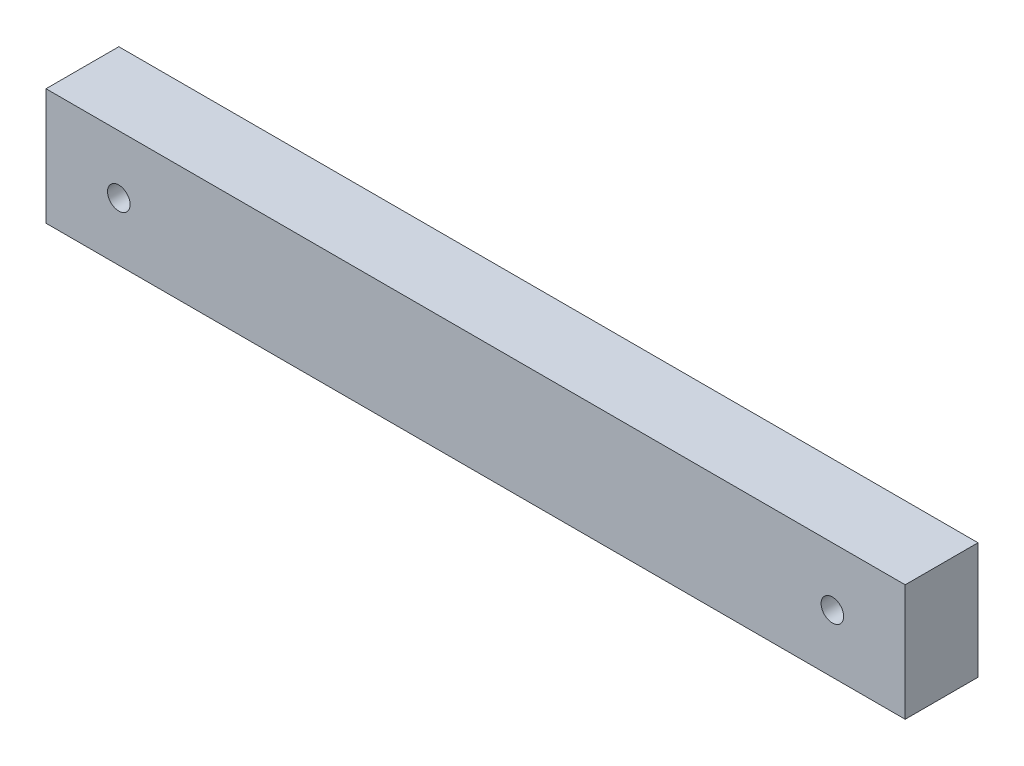
ISO-10303-21;
HEADER;
FILE_DESCRIPTION(('STEP AP214'),'2;1');
FILE_NAME('part.step','',(''),(''),'','','');
FILE_SCHEMA(('AUTOMOTIVE_DESIGN { 1 0 10303 214 1 1 1 1 }'));
ENDSEC;
DATA;
#1=APPLICATION_CONTEXT('core data for automotive mechanical design processes');
#2=APPLICATION_PROTOCOL_DEFINITION('international standard','automotive_design',2000,#1);
#3=PRODUCT_CONTEXT('',#1,'mechanical');
#4=PRODUCT('Part','Part','',(#3));
#5=PRODUCT_RELATED_PRODUCT_CATEGORY('part','',(#4));
#6=PRODUCT_DEFINITION_FORMATION('','',#4);
#7=PRODUCT_DEFINITION_CONTEXT('part definition',#1,'design');
#8=PRODUCT_DEFINITION('design','',#6,#7);
#9=PRODUCT_DEFINITION_SHAPE('','',#8);
#10=(LENGTH_UNIT() NAMED_UNIT(*) SI_UNIT(.MILLI.,.METRE.));
#11=(NAMED_UNIT(*) PLANE_ANGLE_UNIT() SI_UNIT($,.RADIAN.));
#12=(NAMED_UNIT(*) SI_UNIT($,.STERADIAN.) SOLID_ANGLE_UNIT());
#13=UNCERTAINTY_MEASURE_WITH_UNIT(LENGTH_MEASURE(1.E-05),#10,'distance_accuracy_value','');
#14=(GEOMETRIC_REPRESENTATION_CONTEXT(3) GLOBAL_UNCERTAINTY_ASSIGNED_CONTEXT((#13)) GLOBAL_UNIT_ASSIGNED_CONTEXT((#10,
#11,#12)) REPRESENTATION_CONTEXT('',''));
#15=CARTESIAN_POINT('',(0.,0.,0.));
#16=DIRECTION('',(0.,0.,1.));
#17=DIRECTION('',(1.,0.,0.));
#18=AXIS2_PLACEMENT_3D('',#15,#16,#17);
#19=CARTESIAN_POINT('',(0.,0.,10.));
#20=DIRECTION('',(0.,0.,1.));
#21=DIRECTION('',(1.,0.,0.));
#22=AXIS2_PLACEMENT_3D('',#19,#20,#21);
#23=PLANE('',#22);
#24=CARTESIAN_POINT('',(-49.,0.,10.));
#25=DIRECTION('',(0.,0.,1.));
#26=DIRECTION('',(1.,0.,0.));
#27=AXIS2_PLACEMENT_3D('',#24,#25,#26);
#28=CIRCLE('',#27,1.54999999999999);
#29=CARTESIAN_POINT('',(-47.45,0.,10.));
#30=VERTEX_POINT('',#29);
#31=EDGE_CURVE('E105',#30,#30,#28,.T.);
#32=ORIENTED_EDGE('',*,*,#31,.F.);
#33=EDGE_LOOP('',(#32));
#34=FACE_BOUND('',#33,.T.);
#35=DIRECTION('',(0.,1.,0.));
#36=VECTOR('',#35,1.);
#37=CARTESIAN_POINT('',(59.,8.00000000000003,10.));
#38=LINE('',#37,#36);
#39=CARTESIAN_POINT('',(59.,-8.00000000000003,10.));
#40=VERTEX_POINT('',#39);
#41=CARTESIAN_POINT('',(59.,8.00000000000003,10.));
#42=VERTEX_POINT('',#41);
#43=EDGE_CURVE('E90',#40,#42,#38,.T.);
#44=ORIENTED_EDGE('',*,*,#43,.T.);
#45=DIRECTION('',(-1.,0.,0.));
#46=VECTOR('',#45,1.);
#47=CARTESIAN_POINT('',(-59.,8.,10.));
#48=LINE('',#47,#46);
#49=CARTESIAN_POINT('',(-59.,8.,10.));
#50=VERTEX_POINT('',#49);
#51=EDGE_CURVE('E85',#42,#50,#48,.T.);
#52=ORIENTED_EDGE('',*,*,#51,.T.);
#53=DIRECTION('',(0.,-1.,0.));
#54=VECTOR('',#53,1.);
#55=CARTESIAN_POINT('',(-59.,8.,10.));
#56=LINE('',#55,#54);
#57=CARTESIAN_POINT('',(-59.,-8.,10.));
#58=VERTEX_POINT('',#57);
#59=EDGE_CURVE('E88',#50,#58,#56,.T.);
#60=ORIENTED_EDGE('',*,*,#59,.T.);
#61=DIRECTION('',(1.,0.,0.));
#62=VECTOR('',#61,1.);
#63=CARTESIAN_POINT('',(-59.,-8.,10.));
#64=LINE('',#63,#62);
#65=EDGE_CURVE('E55',#58,#40,#64,.T.);
#66=ORIENTED_EDGE('',*,*,#65,.T.);
#67=EDGE_LOOP('',(#44,#52,#60,#66));
#68=FACE_BOUND('',#67,.T.);
#69=CARTESIAN_POINT('',(49.,0.,10.));
#70=DIRECTION('',(0.,0.,1.));
#71=DIRECTION('',(1.,0.,0.));
#72=AXIS2_PLACEMENT_3D('',#69,#70,#71);
#73=CIRCLE('',#72,1.54999999999999);
#74=CARTESIAN_POINT('',(50.55,0.,10.));
#75=VERTEX_POINT('',#74);
#76=EDGE_CURVE('E120',#75,#75,#73,.T.);
#77=ORIENTED_EDGE('',*,*,#76,.F.);
#78=EDGE_LOOP('',(#77));
#79=FACE_BOUND('',#78,.T.);
#80=ADVANCED_FACE('F38',(#34,#68,#79),#23,.T.);
#81=CARTESIAN_POINT('',(0.,0.,0.));
#82=DIRECTION('',(0.,0.,1.));
#83=DIRECTION('',(1.,0.,0.));
#84=AXIS2_PLACEMENT_3D('',#81,#82,#83);
#85=PLANE('',#84);
#86=DIRECTION('',(0.,1.,0.));
#87=VECTOR('',#86,1.);
#88=CARTESIAN_POINT('',(59.,8.00000000000003,0.));
#89=LINE('',#88,#87);
#90=CARTESIAN_POINT('',(59.,-8.00000000000003,0.));
#91=VERTEX_POINT('',#90);
#92=CARTESIAN_POINT('',(59.,8.00000000000003,0.));
#93=VERTEX_POINT('',#92);
#94=EDGE_CURVE('E102',#91,#93,#89,.T.);
#95=ORIENTED_EDGE('',*,*,#94,.F.);
#96=DIRECTION('',(1.,0.,0.));
#97=VECTOR('',#96,1.);
#98=CARTESIAN_POINT('',(-59.,-8.,0.));
#99=LINE('',#98,#97);
#100=CARTESIAN_POINT('',(-59.,-8.,0.));
#101=VERTEX_POINT('',#100);
#102=EDGE_CURVE('E78',#101,#91,#99,.T.);
#103=ORIENTED_EDGE('',*,*,#102,.F.);
#104=DIRECTION('',(0.,-1.,0.));
#105=VECTOR('',#104,1.);
#106=CARTESIAN_POINT('',(-59.,8.,0.));
#107=LINE('',#106,#105);
#108=CARTESIAN_POINT('',(-59.,8.,0.));
#109=VERTEX_POINT('',#108);
#110=EDGE_CURVE('E72',#109,#101,#107,.T.);
#111=ORIENTED_EDGE('',*,*,#110,.F.);
#112=DIRECTION('',(-1.,0.,0.));
#113=VECTOR('',#112,1.);
#114=CARTESIAN_POINT('',(-59.,8.,0.));
#115=LINE('',#114,#113);
#116=EDGE_CURVE('E94',#93,#109,#115,.T.);
#117=ORIENTED_EDGE('',*,*,#116,.F.);
#118=EDGE_LOOP('',(#95,#103,#111,#117));
#119=FACE_BOUND('',#118,.T.);
#120=CARTESIAN_POINT('',(-49.,0.,0.));
#121=DIRECTION('',(0.,0.,1.));
#122=DIRECTION('',(1.,0.,0.));
#123=AXIS2_PLACEMENT_3D('',#120,#121,#122);
#124=CIRCLE('',#123,1.54999999999999);
#125=CARTESIAN_POINT('',(-47.45,0.,0.));
#126=VERTEX_POINT('',#125);
#127=EDGE_CURVE('E117',#126,#126,#124,.T.);
#128=ORIENTED_EDGE('',*,*,#127,.T.);
#129=EDGE_LOOP('',(#128));
#130=FACE_BOUND('',#129,.T.);
#131=CARTESIAN_POINT('',(49.,0.,0.));
#132=DIRECTION('',(0.,0.,1.));
#133=DIRECTION('',(1.,0.,0.));
#134=AXIS2_PLACEMENT_3D('',#131,#132,#133);
#135=CIRCLE('',#134,1.54999999999999);
#136=CARTESIAN_POINT('',(50.55,0.,0.));
#137=VERTEX_POINT('',#136);
#138=EDGE_CURVE('E123',#137,#137,#135,.T.);
#139=ORIENTED_EDGE('',*,*,#138,.T.);
#140=EDGE_LOOP('',(#139));
#141=FACE_BOUND('',#140,.T.);
#142=ADVANCED_FACE('F113',(#119,#130,#141),#85,.F.);
#143=CARTESIAN_POINT('',(59.,8.00000000000003,10.));
#144=DIRECTION('',(-1.,0.,0.));
#145=DIRECTION('',(0.,0.,1.));
#146=AXIS2_PLACEMENT_3D('',#143,#144,#145);
#147=PLANE('',#146);
#148=ORIENTED_EDGE('',*,*,#94,.T.);
#149=DIRECTION('',(0.,0.,-1.));
#150=VECTOR('',#149,1.);
#151=CARTESIAN_POINT('',(59.,8.00000000000003,10.));
#152=LINE('',#151,#150);
#153=EDGE_CURVE('E11',#42,#93,#152,.T.);
#154=ORIENTED_EDGE('',*,*,#153,.F.);
#155=ORIENTED_EDGE('',*,*,#43,.F.);
#156=DIRECTION('',(0.,0.,-1.));
#157=VECTOR('',#156,1.);
#158=CARTESIAN_POINT('',(59.,-8.00000000000003,10.));
#159=LINE('',#158,#157);
#160=EDGE_CURVE('E98',#40,#91,#159,.T.);
#161=ORIENTED_EDGE('',*,*,#160,.T.);
#162=EDGE_LOOP('',(#148,#154,#155,#161));
#163=FACE_BOUND('',#162,.T.);
#164=ADVANCED_FACE('F40',(#163),#147,.F.);
#165=CARTESIAN_POINT('',(-59.,8.,10.));
#166=DIRECTION('',(0.,-1.,0.));
#167=DIRECTION('',(1.,0.,0.));
#168=AXIS2_PLACEMENT_3D('',#165,#166,#167);
#169=PLANE('',#168);
#170=ORIENTED_EDGE('',*,*,#116,.T.);
#171=DIRECTION('',(0.,0.,-1.));
#172=VECTOR('',#171,1.);
#173=CARTESIAN_POINT('',(-59.,8.,10.));
#174=LINE('',#173,#172);
#175=EDGE_CURVE('E47',#50,#109,#174,.T.);
#176=ORIENTED_EDGE('',*,*,#175,.F.);
#177=ORIENTED_EDGE('',*,*,#51,.F.);
#178=ORIENTED_EDGE('',*,*,#153,.T.);
#179=EDGE_LOOP('',(#170,#176,#177,#178));
#180=FACE_BOUND('',#179,.T.);
#181=ADVANCED_FACE('F93',(#180),#169,.F.);
#182=CARTESIAN_POINT('',(-59.,8.,10.));
#183=DIRECTION('',(1.,0.,0.));
#184=DIRECTION('',(0.,0.,-1.));
#185=AXIS2_PLACEMENT_3D('',#182,#183,#184);
#186=PLANE('',#185);
#187=ORIENTED_EDGE('',*,*,#110,.T.);
#188=DIRECTION('',(0.,0.,-1.));
#189=VECTOR('',#188,1.);
#190=CARTESIAN_POINT('',(-59.,-8.,10.));
#191=LINE('',#190,#189);
#192=EDGE_CURVE('E95',#58,#101,#191,.T.);
#193=ORIENTED_EDGE('',*,*,#192,.F.);
#194=ORIENTED_EDGE('',*,*,#59,.F.);
#195=ORIENTED_EDGE('',*,*,#175,.T.);
#196=EDGE_LOOP('',(#187,#193,#194,#195));
#197=FACE_BOUND('',#196,.T.);
#198=ADVANCED_FACE('F96',(#197),#186,.F.);
#199=CARTESIAN_POINT('',(-59.,-8.,10.));
#200=DIRECTION('',(0.,1.,0.));
#201=DIRECTION('',(-1.,0.,0.));
#202=AXIS2_PLACEMENT_3D('',#199,#200,#201);
#203=PLANE('',#202);
#204=ORIENTED_EDGE('',*,*,#102,.T.);
#205=ORIENTED_EDGE('',*,*,#160,.F.);
#206=ORIENTED_EDGE('',*,*,#65,.F.);
#207=ORIENTED_EDGE('',*,*,#192,.T.);
#208=EDGE_LOOP('',(#204,#205,#206,#207));
#209=FACE_BOUND('',#208,.T.);
#210=ADVANCED_FACE('F110',(#209),#203,.F.);
#211=CARTESIAN_POINT('',(-49.,0.,10.));
#212=DIRECTION('',(0.,0.,-1.));
#213=DIRECTION('',(-1.,0.,0.));
#214=AXIS2_PLACEMENT_3D('',#211,#212,#213);
#215=CYLINDRICAL_SURFACE('',#214,1.54999999999999);
#216=ORIENTED_EDGE('',*,*,#31,.T.);
#217=EDGE_LOOP('',(#216));
#218=FACE_BOUND('',#217,.T.);
#219=ORIENTED_EDGE('',*,*,#127,.F.);
#220=EDGE_LOOP('',(#219));
#221=FACE_BOUND('',#220,.T.);
#222=ADVANCED_FACE('F140',(#218,#221),#215,.F.);
#223=CARTESIAN_POINT('',(49.,0.,10.));
#224=DIRECTION('',(0.,0.,-1.));
#225=DIRECTION('',(-1.,0.,0.));
#226=AXIS2_PLACEMENT_3D('',#223,#224,#225);
#227=CYLINDRICAL_SURFACE('',#226,1.54999999999999);
#228=ORIENTED_EDGE('',*,*,#76,.T.);
#229=EDGE_LOOP('',(#228));
#230=FACE_BOUND('',#229,.T.);
#231=ORIENTED_EDGE('',*,*,#138,.F.);
#232=EDGE_LOOP('',(#231));
#233=FACE_BOUND('',#232,.T.);
#234=ADVANCED_FACE('F129',(#230,#233),#227,.F.);
#235=CLOSED_SHELL('',(#80,#142,#164,#181,#198,#210,#222,#234));
#236=MANIFOLD_SOLID_BREP('B2',#235);
#237=ADVANCED_BREP_SHAPE_REPRESENTATION('',(#18,#236),#14);
#238=SHAPE_DEFINITION_REPRESENTATION(#9,#237);
ENDSEC;
END-ISO-10303-21;
